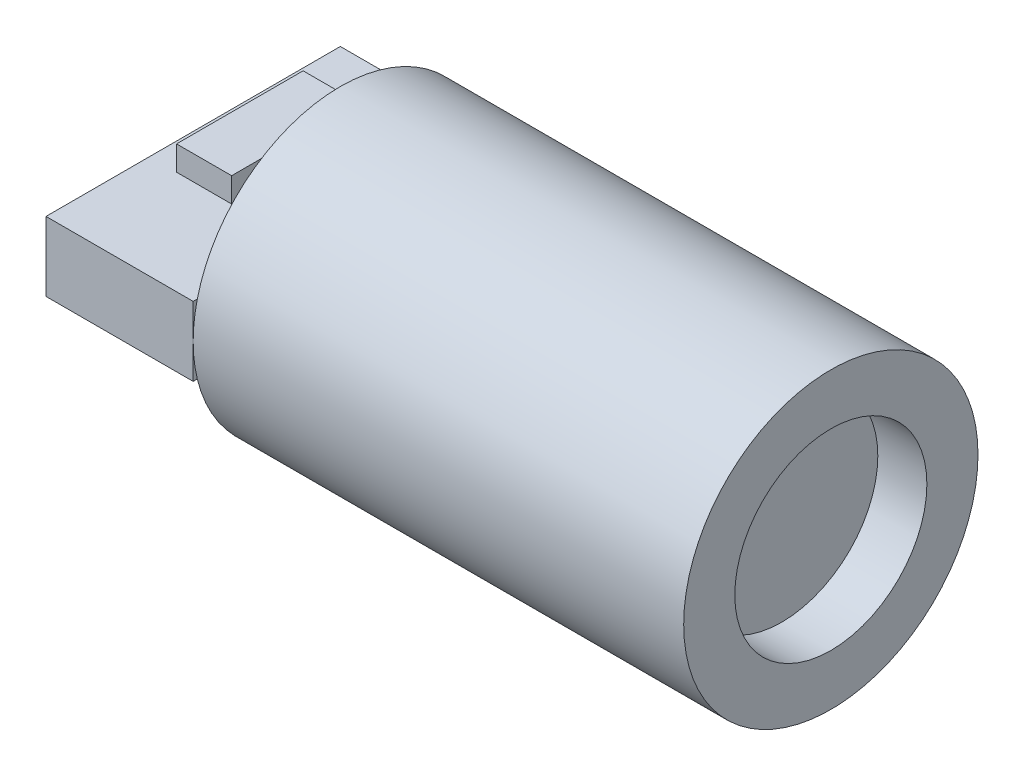
ISO-10303-21;
HEADER;
FILE_DESCRIPTION(('STEP AP214'),'2;1');
FILE_NAME('part.step','',(''),(''),'','','');
FILE_SCHEMA(('AUTOMOTIVE_DESIGN { 1 0 10303 214 1 1 1 1 }'));
ENDSEC;
DATA;
#1=APPLICATION_CONTEXT('core data for automotive mechanical design processes');
#2=APPLICATION_PROTOCOL_DEFINITION('international standard','automotive_design',2000,#1);
#3=PRODUCT_CONTEXT('',#1,'mechanical');
#4=PRODUCT('Part','Part','',(#3));
#5=PRODUCT_RELATED_PRODUCT_CATEGORY('part','',(#4));
#6=PRODUCT_DEFINITION_FORMATION('','',#4);
#7=PRODUCT_DEFINITION_CONTEXT('part definition',#1,'design');
#8=PRODUCT_DEFINITION('design','',#6,#7);
#9=PRODUCT_DEFINITION_SHAPE('','',#8);
#10=(LENGTH_UNIT() NAMED_UNIT(*) SI_UNIT(.MILLI.,.METRE.));
#11=(NAMED_UNIT(*) PLANE_ANGLE_UNIT() SI_UNIT($,.RADIAN.));
#12=(NAMED_UNIT(*) SI_UNIT($,.STERADIAN.) SOLID_ANGLE_UNIT());
#13=UNCERTAINTY_MEASURE_WITH_UNIT(LENGTH_MEASURE(1.E-05),#10,'distance_accuracy_value','');
#14=(GEOMETRIC_REPRESENTATION_CONTEXT(3) GLOBAL_UNCERTAINTY_ASSIGNED_CONTEXT((#13)) GLOBAL_UNIT_ASSIGNED_CONTEXT((#10,
#11,#12)) REPRESENTATION_CONTEXT('',''));
#15=CARTESIAN_POINT('',(0.,0.,0.));
#16=DIRECTION('',(0.,0.,1.));
#17=DIRECTION('',(1.,0.,0.));
#18=AXIS2_PLACEMENT_3D('',#15,#16,#17);
#19=CARTESIAN_POINT('',(-3.,0.706733621691599,-3.));
#20=DIRECTION('',(0.,-1.,0.));
#21=DIRECTION('',(0.,0.,-1.));
#22=AXIS2_PLACEMENT_3D('',#19,#20,#21);
#23=PLANE('',#22);
#24=DIRECTION('',(0.,0.,-1.));
#25=VECTOR('',#24,1.);
#26=CARTESIAN_POINT('',(0.,0.706733621691599,-3.));
#27=LINE('',#26,#25);
#28=CARTESIAN_POINT('',(0.,0.706733621691599,3.));
#29=VERTEX_POINT('',#28);
#30=CARTESIAN_POINT('',(0.,0.706733621691599,2.91556642660919));
#31=VERTEX_POINT('',#30);
#32=EDGE_CURVE('E163',#29,#31,#27,.T.);
#33=ORIENTED_EDGE('',*,*,#32,.T.);
#34=CARTESIAN_POINT('',(0.,0.706733621691599,-2.91556642660919));
#35=VERTEX_POINT('',#34);
#36=EDGE_CURVE('E44',#31,#35,#27,.T.);
#37=ORIENTED_EDGE('',*,*,#36,.T.);
#38=CARTESIAN_POINT('',(0.,0.706733621691599,-3.));
#39=VERTEX_POINT('',#38);
#40=EDGE_CURVE('E162',#35,#39,#27,.T.);
#41=ORIENTED_EDGE('',*,*,#40,.T.);
#42=DIRECTION('',(1.,0.,0.));
#43=VECTOR('',#42,1.);
#44=CARTESIAN_POINT('',(-3.,0.706733621691599,-3.));
#45=LINE('',#44,#43);
#46=CARTESIAN_POINT('',(-3.,0.706733621691599,-3.));
#47=VERTEX_POINT('',#46);
#48=EDGE_CURVE('E176',#47,#39,#45,.T.);
#49=ORIENTED_EDGE('',*,*,#48,.F.);
#50=DIRECTION('',(0.,0.,-1.));
#51=VECTOR('',#50,1.);
#52=CARTESIAN_POINT('',(-3.,0.706733621691599,-3.));
#53=LINE('',#52,#51);
#54=CARTESIAN_POINT('',(-3.,0.706733621691599,3.));
#55=VERTEX_POINT('',#54);
#56=EDGE_CURVE('E154',#55,#47,#53,.T.);
#57=ORIENTED_EDGE('',*,*,#56,.F.);
#58=DIRECTION('',(1.,0.,0.));
#59=VECTOR('',#58,1.);
#60=CARTESIAN_POINT('',(-3.,0.706733621691599,3.));
#61=LINE('',#60,#59);
#62=EDGE_CURVE('E179',#55,#29,#61,.T.);
#63=ORIENTED_EDGE('',*,*,#62,.T.);
#64=EDGE_LOOP('',(#33,#37,#41,#49,#57,#63));
#65=FACE_BOUND('',#64,.T.);
#66=DIRECTION('',(0.,0.,1.));
#67=VECTOR('',#66,1.);
#68=CARTESIAN_POINT('',(-2.44964201551648,0.706733621691599,-1.69130273025357));
#69=LINE('',#68,#67);
#70=CARTESIAN_POINT('',(-2.44964201551648,0.706733621691599,-1.69130273025357));
#71=VERTEX_POINT('',#70);
#72=CARTESIAN_POINT('',(-2.44964201551648,0.706733621691599,0.889103806813132));
#73=VERTEX_POINT('',#72);
#74=EDGE_CURVE('E142',#71,#73,#69,.T.);
#75=ORIENTED_EDGE('',*,*,#74,.F.);
#76=DIRECTION('',(-1.,0.,0.));
#77=VECTOR('',#76,1.);
#78=CARTESIAN_POINT('',(-2.44964201551648,0.706733621691599,-1.69130273025357));
#79=LINE('',#78,#77);
#80=CARTESIAN_POINT('',(-1.32656352269988,0.706733621691599,-1.69130273025357));
#81=VERTEX_POINT('',#80);
#82=EDGE_CURVE('E139',#81,#71,#79,.T.);
#83=ORIENTED_EDGE('',*,*,#82,.F.);
#84=DIRECTION('',(0.,0.,-1.));
#85=VECTOR('',#84,1.);
#86=CARTESIAN_POINT('',(-1.32656352269988,0.706733621691599,-1.69130273025357));
#87=LINE('',#86,#85);
#88=CARTESIAN_POINT('',(-1.32656352269988,0.706733621691599,0.889103806813132));
#89=VERTEX_POINT('',#88);
#90=EDGE_CURVE('E59',#89,#81,#87,.T.);
#91=ORIENTED_EDGE('',*,*,#90,.F.);
#92=DIRECTION('',(1.,0.,0.));
#93=VECTOR('',#92,1.);
#94=CARTESIAN_POINT('',(-2.44964201551648,0.706733621691599,0.889103806813132));
#95=LINE('',#94,#93);
#96=EDGE_CURVE('E54',#73,#89,#95,.T.);
#97=ORIENTED_EDGE('',*,*,#96,.F.);
#98=EDGE_LOOP('',(#75,#83,#91,#97));
#99=FACE_BOUND('',#98,.T.);
#100=ADVANCED_FACE('F35',(#65,#99),#23,.F.);
#101=CARTESIAN_POINT('',(0.,0.,0.));
#102=DIRECTION('',(1.,0.,0.));
#103=DIRECTION('',(0.,0.,-1.));
#104=AXIS2_PLACEMENT_3D('',#101,#102,#103);
#105=PLANE('',#104);
#106=DIRECTION('',(0.,0.,1.));
#107=VECTOR('',#106,1.);
#108=CARTESIAN_POINT('',(0.,-0.706733621691599,-3.));
#109=LINE('',#108,#107);
#110=CARTESIAN_POINT('',(0.,-0.706733621691599,-2.91556642660919));
#111=VERTEX_POINT('',#110);
#112=CARTESIAN_POINT('',(0.,-0.706733621691599,2.91556642660919));
#113=VERTEX_POINT('',#112);
#114=EDGE_CURVE('E11',#111,#113,#109,.T.);
#115=ORIENTED_EDGE('',*,*,#114,.F.);
#116=CARTESIAN_POINT('',(0.,0.,0.));
#117=DIRECTION('',(1.,0.,0.));
#118=DIRECTION('',(0.,0.,-1.));
#119=AXIS2_PLACEMENT_3D('',#116,#117,#118);
#120=CIRCLE('',#119,3.);
#121=EDGE_CURVE('E199',#113,#111,#120,.T.);
#122=ORIENTED_EDGE('',*,*,#121,.F.);
#123=EDGE_LOOP('',(#115,#122));
#124=FACE_BOUND('',#123,.T.);
#125=ADVANCED_FACE('F224',(#124),#105,.F.);
#126=ORIENTED_EDGE('',*,*,#36,.F.);
#127=EDGE_CURVE('E193',#35,#31,#120,.T.);
#128=ORIENTED_EDGE('',*,*,#127,.F.);
#129=EDGE_LOOP('',(#126,#128));
#130=FACE_BOUND('',#129,.T.);
#131=ADVANCED_FACE('F226',(#130),#105,.F.);
#132=CARTESIAN_POINT('',(10.,0.,0.));
#133=DIRECTION('',(-1.,0.,0.));
#134=DIRECTION('',(0.,0.,1.));
#135=AXIS2_PLACEMENT_3D('',#132,#133,#134);
#136=CYLINDRICAL_SURFACE('',#135,3.);
#137=CARTESIAN_POINT('',(10.,0.,0.));
#138=DIRECTION('',(1.,0.,0.));
#139=DIRECTION('',(0.,0.,-1.));
#140=AXIS2_PLACEMENT_3D('',#137,#138,#139);
#141=CIRCLE('',#140,3.);
#142=CARTESIAN_POINT('',(10.,0.,-3.));
#143=VERTEX_POINT('',#142);
#144=EDGE_CURVE('E188',#143,#143,#141,.T.);
#145=ORIENTED_EDGE('',*,*,#144,.F.);
#146=EDGE_LOOP('',(#145));
#147=FACE_BOUND('',#146,.T.);
#148=CARTESIAN_POINT('',(0.,0.,-3.));
#149=VERTEX_POINT('',#148);
#150=EDGE_CURVE('E39',#149,#35,#120,.T.);
#151=ORIENTED_EDGE('',*,*,#150,.T.);
#152=ORIENTED_EDGE('',*,*,#127,.T.);
#153=CARTESIAN_POINT('',(0.,0.,3.));
#154=VERTEX_POINT('',#153);
#155=EDGE_CURVE('E198',#31,#154,#120,.T.);
#156=ORIENTED_EDGE('',*,*,#155,.T.);
#157=EDGE_CURVE('E202',#154,#113,#120,.T.);
#158=ORIENTED_EDGE('',*,*,#157,.T.);
#159=ORIENTED_EDGE('',*,*,#121,.T.);
#160=EDGE_CURVE('E186',#111,#149,#120,.T.);
#161=ORIENTED_EDGE('',*,*,#160,.T.);
#162=EDGE_LOOP('',(#151,#152,#156,#158,#159,#161));
#163=FACE_BOUND('',#162,.T.);
#164=ADVANCED_FACE('F37',(#147,#163),#136,.T.);
#165=CARTESIAN_POINT('',(10.,0.,0.));
#166=DIRECTION('',(1.,0.,0.));
#167=DIRECTION('',(0.,0.,-1.));
#168=AXIS2_PLACEMENT_3D('',#165,#166,#167);
#169=PLANE('',#168);
#170=CARTESIAN_POINT('',(10.,0.,0.));
#171=DIRECTION('',(1.,0.,0.));
#172=DIRECTION('',(0.,0.,-1.));
#173=AXIS2_PLACEMENT_3D('',#170,#171,#172);
#174=CIRCLE('',#173,1.95786677535411);
#175=CARTESIAN_POINT('',(10.,0.,-1.95786677535411));
#176=VERTEX_POINT('',#175);
#177=EDGE_CURVE('E182',#176,#176,#174,.T.);
#178=ORIENTED_EDGE('',*,*,#177,.F.);
#179=EDGE_LOOP('',(#178));
#180=FACE_BOUND('',#179,.T.);
#181=ORIENTED_EDGE('',*,*,#144,.T.);
#182=EDGE_LOOP('',(#181));
#183=FACE_BOUND('',#182,.T.);
#184=ADVANCED_FACE('F235',(#180,#183),#169,.T.);
#185=CARTESIAN_POINT('',(9.,0.,0.));
#186=DIRECTION('',(1.,0.,0.));
#187=DIRECTION('',(0.,0.,-1.));
#188=AXIS2_PLACEMENT_3D('',#185,#186,#187);
#189=CYLINDRICAL_SURFACE('',#188,1.95786677535411);
#190=CARTESIAN_POINT('',(9.,0.,0.));
#191=DIRECTION('',(1.,0.,0.));
#192=DIRECTION('',(0.,0.,-1.));
#193=AXIS2_PLACEMENT_3D('',#190,#191,#192);
#194=CIRCLE('',#193,1.95786677535411);
#195=CARTESIAN_POINT('',(9.,0.,-1.95786677535411));
#196=VERTEX_POINT('',#195);
#197=EDGE_CURVE('E183',#196,#196,#194,.T.);
#198=ORIENTED_EDGE('',*,*,#197,.F.);
#199=EDGE_LOOP('',(#198));
#200=FACE_BOUND('',#199,.T.);
#201=ORIENTED_EDGE('',*,*,#177,.T.);
#202=EDGE_LOOP('',(#201));
#203=FACE_BOUND('',#202,.T.);
#204=ADVANCED_FACE('F238',(#200,#203),#189,.F.);
#205=CARTESIAN_POINT('',(9.,0.,0.));
#206=DIRECTION('',(1.,0.,0.));
#207=DIRECTION('',(0.,0.,-1.));
#208=AXIS2_PLACEMENT_3D('',#205,#206,#207);
#209=PLANE('',#208);
#210=ORIENTED_EDGE('',*,*,#197,.T.);
#211=EDGE_LOOP('',(#210));
#212=FACE_BOUND('',#211,.T.);
#213=ADVANCED_FACE('F242',(#212),#209,.T.);
#214=CARTESIAN_POINT('',(0.,0.,0.));
#215=DIRECTION('',(-1.,0.,0.));
#216=DIRECTION('',(0.,0.,1.));
#217=AXIS2_PLACEMENT_3D('',#214,#215,#216);
#218=PLANE('',#217);
#219=ORIENTED_EDGE('',*,*,#155,.F.);
#220=ORIENTED_EDGE('',*,*,#32,.F.);
#221=DIRECTION('',(0.,1.,0.));
#222=VECTOR('',#221,1.);
#223=CARTESIAN_POINT('',(0.,0.706733621691599,3.));
#224=LINE('',#223,#222);
#225=EDGE_CURVE('E143',#154,#29,#224,.T.);
#226=ORIENTED_EDGE('',*,*,#225,.F.);
#227=EDGE_LOOP('',(#219,#220,#226));
#228=FACE_BOUND('',#227,.T.);
#229=ADVANCED_FACE('F213',(#228),#218,.F.);
#230=ORIENTED_EDGE('',*,*,#157,.F.);
#231=CARTESIAN_POINT('',(0.,-0.706733621691599,3.));
#232=VERTEX_POINT('',#231);
#233=EDGE_CURVE('E145',#232,#154,#224,.T.);
#234=ORIENTED_EDGE('',*,*,#233,.F.);
#235=EDGE_CURVE('E47',#113,#232,#109,.T.);
#236=ORIENTED_EDGE('',*,*,#235,.F.);
#237=EDGE_LOOP('',(#230,#234,#236));
#238=FACE_BOUND('',#237,.T.);
#239=ADVANCED_FACE('F212',(#238),#218,.F.);
#240=ORIENTED_EDGE('',*,*,#150,.F.);
#241=DIRECTION('',(0.,-1.,0.));
#242=VECTOR('',#241,1.);
#243=CARTESIAN_POINT('',(0.,0.706733621691599,-3.));
#244=LINE('',#243,#242);
#245=EDGE_CURVE('E167',#39,#149,#244,.T.);
#246=ORIENTED_EDGE('',*,*,#245,.F.);
#247=ORIENTED_EDGE('',*,*,#40,.F.);
#248=EDGE_LOOP('',(#240,#246,#247));
#249=FACE_BOUND('',#248,.T.);
#250=ADVANCED_FACE('F249',(#249),#218,.F.);
#251=CARTESIAN_POINT('',(-3.,0.706733621691599,3.));
#252=DIRECTION('',(0.,0.,-1.));
#253=DIRECTION('',(-1.,0.,0.));
#254=AXIS2_PLACEMENT_3D('',#251,#252,#253);
#255=PLANE('',#254);
#256=ORIENTED_EDGE('',*,*,#233,.T.);
#257=ORIENTED_EDGE('',*,*,#225,.T.);
#258=ORIENTED_EDGE('',*,*,#62,.F.);
#259=DIRECTION('',(0.,1.,0.));
#260=VECTOR('',#259,1.);
#261=CARTESIAN_POINT('',(-3.,0.706733621691599,3.));
#262=LINE('',#261,#260);
#263=CARTESIAN_POINT('',(-3.,-0.706733621691599,3.));
#264=VERTEX_POINT('',#263);
#265=EDGE_CURVE('E151',#264,#55,#262,.T.);
#266=ORIENTED_EDGE('',*,*,#265,.F.);
#267=DIRECTION('',(1.,0.,0.));
#268=VECTOR('',#267,1.);
#269=CARTESIAN_POINT('',(-3.,-0.706733621691599,3.));
#270=LINE('',#269,#268);
#271=EDGE_CURVE('E159',#264,#232,#270,.T.);
#272=ORIENTED_EDGE('',*,*,#271,.T.);
#273=EDGE_LOOP('',(#256,#257,#258,#266,#272));
#274=FACE_BOUND('',#273,.T.);
#275=ADVANCED_FACE('F216',(#274),#255,.F.);
#276=CARTESIAN_POINT('',(-3.,0.706733621691599,-3.));
#277=DIRECTION('',(0.,0.,1.));
#278=DIRECTION('',(1.,0.,0.));
#279=AXIS2_PLACEMENT_3D('',#276,#277,#278);
#280=PLANE('',#279);
#281=ORIENTED_EDGE('',*,*,#245,.T.);
#282=CARTESIAN_POINT('',(0.,-0.706733621691599,-3.));
#283=VERTEX_POINT('',#282);
#284=EDGE_CURVE('E166',#149,#283,#244,.T.);
#285=ORIENTED_EDGE('',*,*,#284,.T.);
#286=DIRECTION('',(1.,0.,0.));
#287=VECTOR('',#286,1.);
#288=CARTESIAN_POINT('',(-3.,-0.706733621691599,-3.));
#289=LINE('',#288,#287);
#290=CARTESIAN_POINT('',(-3.,-0.706733621691599,-3.));
#291=VERTEX_POINT('',#290);
#292=EDGE_CURVE('E173',#291,#283,#289,.T.);
#293=ORIENTED_EDGE('',*,*,#292,.F.);
#294=DIRECTION('',(0.,-1.,0.));
#295=VECTOR('',#294,1.);
#296=CARTESIAN_POINT('',(-3.,0.706733621691599,-3.));
#297=LINE('',#296,#295);
#298=EDGE_CURVE('E156',#47,#291,#297,.T.);
#299=ORIENTED_EDGE('',*,*,#298,.F.);
#300=ORIENTED_EDGE('',*,*,#48,.T.);
#301=EDGE_LOOP('',(#281,#285,#293,#299,#300));
#302=FACE_BOUND('',#301,.T.);
#303=ADVANCED_FACE('F248',(#302),#280,.F.);
#304=CARTESIAN_POINT('',(-3.,-0.706733621691599,-3.));
#305=DIRECTION('',(0.,1.,0.));
#306=DIRECTION('',(0.,0.,1.));
#307=AXIS2_PLACEMENT_3D('',#304,#305,#306);
#308=PLANE('',#307);
#309=EDGE_CURVE('E46',#283,#111,#109,.T.);
#310=ORIENTED_EDGE('',*,*,#309,.T.);
#311=ORIENTED_EDGE('',*,*,#114,.T.);
#312=ORIENTED_EDGE('',*,*,#235,.T.);
#313=ORIENTED_EDGE('',*,*,#271,.F.);
#314=DIRECTION('',(0.,0.,1.));
#315=VECTOR('',#314,1.);
#316=CARTESIAN_POINT('',(-3.,-0.706733621691599,-3.));
#317=LINE('',#316,#315);
#318=EDGE_CURVE('E158',#291,#264,#317,.T.);
#319=ORIENTED_EDGE('',*,*,#318,.F.);
#320=ORIENTED_EDGE('',*,*,#292,.T.);
#321=EDGE_LOOP('',(#310,#311,#312,#313,#319,#320));
#322=FACE_BOUND('',#321,.T.);
#323=ADVANCED_FACE('F221',(#322),#308,.F.);
#324=CARTESIAN_POINT('',(-3.,0.,0.));
#325=DIRECTION('',(-1.,0.,0.));
#326=DIRECTION('',(0.,0.,1.));
#327=AXIS2_PLACEMENT_3D('',#324,#325,#326);
#328=PLANE('',#327);
#329=ORIENTED_EDGE('',*,*,#265,.T.);
#330=ORIENTED_EDGE('',*,*,#56,.T.);
#331=ORIENTED_EDGE('',*,*,#298,.T.);
#332=ORIENTED_EDGE('',*,*,#318,.T.);
#333=EDGE_LOOP('',(#329,#330,#331,#332));
#334=FACE_BOUND('',#333,.T.);
#335=ADVANCED_FACE('F256',(#334),#328,.T.);
#336=ORIENTED_EDGE('',*,*,#160,.F.);
#337=ORIENTED_EDGE('',*,*,#309,.F.);
#338=ORIENTED_EDGE('',*,*,#284,.F.);
#339=EDGE_LOOP('',(#336,#337,#338));
#340=FACE_BOUND('',#339,.T.);
#341=ADVANCED_FACE('F257',(#340),#218,.F.);
#342=CARTESIAN_POINT('',(-2.44964201551648,1.2067336216916,-1.69130273025357));
#343=DIRECTION('',(1.,0.,0.));
#344=DIRECTION('',(0.,0.,-1.));
#345=AXIS2_PLACEMENT_3D('',#342,#343,#344);
#346=PLANE('',#345);
#347=ORIENTED_EDGE('',*,*,#74,.T.);
#348=DIRECTION('',(0.,-1.,0.));
#349=VECTOR('',#348,1.);
#350=CARTESIAN_POINT('',(-2.44964201551648,1.2067336216916,0.889103806813132));
#351=LINE('',#350,#349);
#352=CARTESIAN_POINT('',(-2.44964201551648,1.2067336216916,0.889103806813132));
#353=VERTEX_POINT('',#352);
#354=EDGE_CURVE('E123',#353,#73,#351,.T.);
#355=ORIENTED_EDGE('',*,*,#354,.F.);
#356=DIRECTION('',(0.,0.,1.));
#357=VECTOR('',#356,1.);
#358=CARTESIAN_POINT('',(-2.44964201551648,1.2067336216916,-1.69130273025357));
#359=LINE('',#358,#357);
#360=CARTESIAN_POINT('',(-2.44964201551648,1.2067336216916,-1.69130273025357));
#361=VERTEX_POINT('',#360);
#362=EDGE_CURVE('E130',#361,#353,#359,.T.);
#363=ORIENTED_EDGE('',*,*,#362,.F.);
#364=DIRECTION('',(0.,-1.,0.));
#365=VECTOR('',#364,1.);
#366=CARTESIAN_POINT('',(-2.44964201551648,1.2067336216916,-1.69130273025357));
#367=LINE('',#366,#365);
#368=EDGE_CURVE('E410',#361,#71,#367,.T.);
#369=ORIENTED_EDGE('',*,*,#368,.T.);
#370=EDGE_LOOP('',(#347,#355,#363,#369));
#371=FACE_BOUND('',#370,.T.);
#372=ADVANCED_FACE('F141',(#371),#346,.F.);
#373=CARTESIAN_POINT('',(-2.44964201551648,1.2067336216916,0.889103806813132));
#374=DIRECTION('',(0.,0.,-1.));
#375=DIRECTION('',(-1.,0.,0.));
#376=AXIS2_PLACEMENT_3D('',#373,#374,#375);
#377=PLANE('',#376);
#378=ORIENTED_EDGE('',*,*,#96,.T.);
#379=DIRECTION('',(0.,-1.,0.));
#380=VECTOR('',#379,1.);
#381=CARTESIAN_POINT('',(-1.32656352269988,1.2067336216916,0.889103806813132));
#382=LINE('',#381,#380);
#383=CARTESIAN_POINT('',(-1.32656352269988,1.2067336216916,0.889103806813132));
#384=VERTEX_POINT('',#383);
#385=EDGE_CURVE('E126',#384,#89,#382,.T.);
#386=ORIENTED_EDGE('',*,*,#385,.F.);
#387=DIRECTION('',(1.,0.,0.));
#388=VECTOR('',#387,1.);
#389=CARTESIAN_POINT('',(-2.44964201551648,1.2067336216916,0.889103806813132));
#390=LINE('',#389,#388);
#391=EDGE_CURVE('E119',#353,#384,#390,.T.);
#392=ORIENTED_EDGE('',*,*,#391,.F.);
#393=ORIENTED_EDGE('',*,*,#354,.T.);
#394=EDGE_LOOP('',(#378,#386,#392,#393));
#395=FACE_BOUND('',#394,.T.);
#396=ADVANCED_FACE('F121',(#395),#377,.F.);
#397=CARTESIAN_POINT('',(-1.32656352269988,1.2067336216916,-1.69130273025357));
#398=DIRECTION('',(-1.,0.,0.));
#399=DIRECTION('',(0.,0.,1.));
#400=AXIS2_PLACEMENT_3D('',#397,#398,#399);
#401=PLANE('',#400);
#402=ORIENTED_EDGE('',*,*,#90,.T.);
#403=DIRECTION('',(0.,-1.,0.));
#404=VECTOR('',#403,1.);
#405=CARTESIAN_POINT('',(-1.32656352269988,1.2067336216916,-1.69130273025357));
#406=LINE('',#405,#404);
#407=CARTESIAN_POINT('',(-1.32656352269988,1.2067336216916,-1.69130273025357));
#408=VERTEX_POINT('',#407);
#409=EDGE_CURVE('E147',#408,#81,#406,.T.);
#410=ORIENTED_EDGE('',*,*,#409,.F.);
#411=DIRECTION('',(0.,0.,-1.));
#412=VECTOR('',#411,1.);
#413=CARTESIAN_POINT('',(-1.32656352269988,1.2067336216916,-1.69130273025357));
#414=LINE('',#413,#412);
#415=EDGE_CURVE('E129',#384,#408,#414,.T.);
#416=ORIENTED_EDGE('',*,*,#415,.F.);
#417=ORIENTED_EDGE('',*,*,#385,.T.);
#418=EDGE_LOOP('',(#402,#410,#416,#417));
#419=FACE_BOUND('',#418,.T.);
#420=ADVANCED_FACE('F268',(#419),#401,.F.);
#421=CARTESIAN_POINT('',(-2.44964201551648,1.2067336216916,-1.69130273025357));
#422=DIRECTION('',(0.,0.,1.));
#423=DIRECTION('',(1.,0.,0.));
#424=AXIS2_PLACEMENT_3D('',#421,#422,#423);
#425=PLANE('',#424);
#426=ORIENTED_EDGE('',*,*,#82,.T.);
#427=ORIENTED_EDGE('',*,*,#368,.F.);
#428=DIRECTION('',(-1.,0.,0.));
#429=VECTOR('',#428,1.);
#430=CARTESIAN_POINT('',(-2.44964201551648,1.2067336216916,-1.69130273025357));
#431=LINE('',#430,#429);
#432=EDGE_CURVE('E135',#408,#361,#431,.T.);
#433=ORIENTED_EDGE('',*,*,#432,.F.);
#434=ORIENTED_EDGE('',*,*,#409,.T.);
#435=EDGE_LOOP('',(#426,#427,#433,#434));
#436=FACE_BOUND('',#435,.T.);
#437=ADVANCED_FACE('F271',(#436),#425,.F.);
#438=CARTESIAN_POINT('',(0.,1.2067336216916,0.));
#439=DIRECTION('',(0.,1.,0.));
#440=DIRECTION('',(0.,0.,1.));
#441=AXIS2_PLACEMENT_3D('',#438,#439,#440);
#442=PLANE('',#441);
#443=ORIENTED_EDGE('',*,*,#362,.T.);
#444=ORIENTED_EDGE('',*,*,#391,.T.);
#445=ORIENTED_EDGE('',*,*,#415,.T.);
#446=ORIENTED_EDGE('',*,*,#432,.T.);
#447=EDGE_LOOP('',(#443,#444,#445,#446));
#448=FACE_BOUND('',#447,.T.);
#449=ADVANCED_FACE('F133',(#448),#442,.T.);
#450=CLOSED_SHELL('',(#100,#125,#131,#164,#184,#204,#213,#229,#239,#250,#275,#303,#323,#335,
#341,#372,#396,#420,#437,#449));
#451=MANIFOLD_SOLID_BREP('B2',#450);
#452=ADVANCED_BREP_SHAPE_REPRESENTATION('',(#18,#451),#14);
#453=SHAPE_DEFINITION_REPRESENTATION(#9,#452);
ENDSEC;
END-ISO-10303-21;
